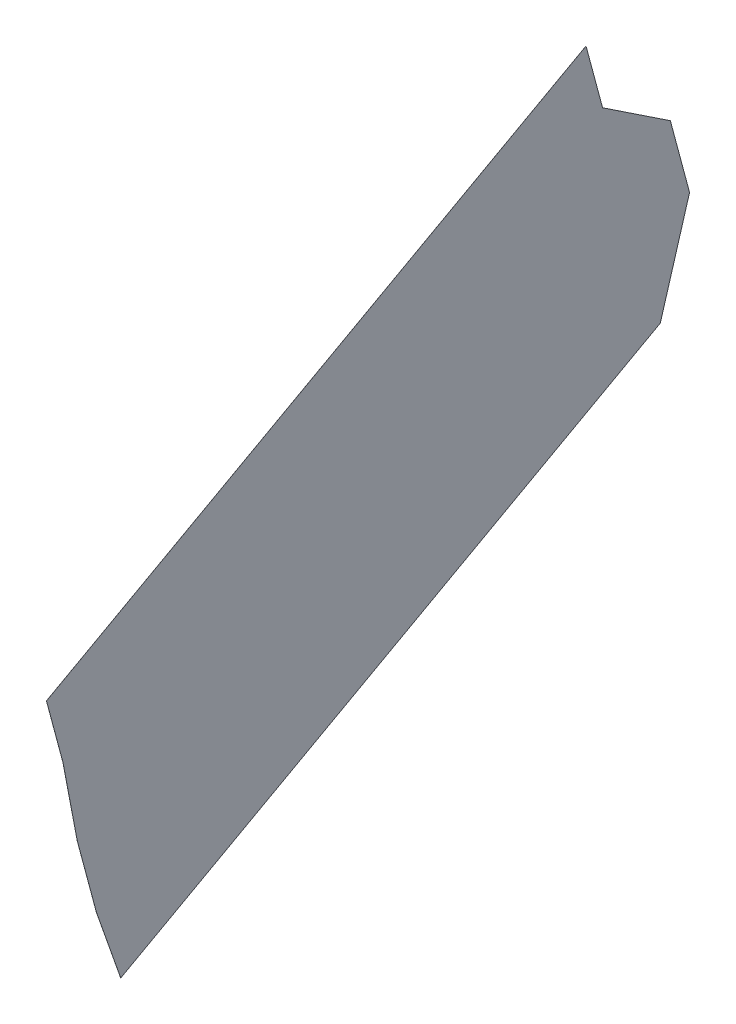
ISO-10303-21;
HEADER;
FILE_DESCRIPTION(('STEP AP214'),'2;1');
FILE_NAME('part.step','',(''),(''),'','','');
FILE_SCHEMA(('AUTOMOTIVE_DESIGN { 1 0 10303 214 1 1 1 1 }'));
ENDSEC;
DATA;
#1=APPLICATION_CONTEXT('core data for automotive mechanical design processes');
#2=APPLICATION_PROTOCOL_DEFINITION('international standard','automotive_design',2000,#1);
#3=PRODUCT_CONTEXT('',#1,'mechanical');
#4=PRODUCT('Part','Part','',(#3));
#5=PRODUCT_RELATED_PRODUCT_CATEGORY('part','',(#4));
#6=PRODUCT_DEFINITION_FORMATION('','',#4);
#7=PRODUCT_DEFINITION_CONTEXT('part definition',#1,'design');
#8=PRODUCT_DEFINITION('design','',#6,#7);
#9=PRODUCT_DEFINITION_SHAPE('','',#8);
#10=(LENGTH_UNIT() NAMED_UNIT(*) SI_UNIT(.MILLI.,.METRE.));
#11=(NAMED_UNIT(*) PLANE_ANGLE_UNIT() SI_UNIT($,.RADIAN.));
#12=(NAMED_UNIT(*) SI_UNIT($,.STERADIAN.) SOLID_ANGLE_UNIT());
#13=UNCERTAINTY_MEASURE_WITH_UNIT(LENGTH_MEASURE(1.E-05),#10,'distance_accuracy_value','');
#14=(GEOMETRIC_REPRESENTATION_CONTEXT(3) GLOBAL_UNCERTAINTY_ASSIGNED_CONTEXT((#13)) GLOBAL_UNIT_ASSIGNED_CONTEXT((#10,
#11,#12)) REPRESENTATION_CONTEXT('',''));
#15=CARTESIAN_POINT('',(0.,0.,0.));
#16=DIRECTION('',(0.,0.,1.));
#17=DIRECTION('',(1.,0.,0.));
#18=AXIS2_PLACEMENT_3D('',#15,#16,#17);
#19=CARTESIAN_POINT('',(92.6858830735072,400.506737260573,-503.289733688324));
#20=DIRECTION('',(0.173648177666827,-0.254887002244184,0.951251242564216));
#21=DIRECTION('',(0.,-0.965925826289068,-0.258819045102522));
#22=AXIS2_PLACEMENT_3D('',#19,#20,#21);
#23=PLANE('',#22);
#24=DIRECTION('',(-0.984807753012227,-0.0449434555275246,0.16773125949642));
#25=VECTOR('',#24,1.);
#26=CARTESIAN_POINT('',(92.6858830735072,400.526055777098,-503.284557307421));
#27=LINE('',#26,#25);
#28=CARTESIAN_POINT('',(92.6957311510374,400.526505211654,-503.286234620016));
#29=VERTEX_POINT('',#28);
#30=CARTESIAN_POINT('',(92.6858830735072,400.526055777098,-503.284557307421));
#31=VERTEX_POINT('',#30);
#32=EDGE_CURVE('E292',#29,#31,#27,.T.);
#33=ORIENTED_EDGE('',*,*,#32,.F.);
#34=DIRECTION('',(0.,-0.965925826289068,-0.258819045102522));
#35=VECTOR('',#34,1.);
#36=CARTESIAN_POINT('',(92.6957311510373,400.507186695128,-503.291411000918));
#37=LINE('',#36,#35);
#38=CARTESIAN_POINT('',(92.6957311510373,425.022384166345,-496.722583636216));
#39=VERTEX_POINT('',#38);
#40=EDGE_CURVE('E282',#39,#29,#37,.T.);
#41=ORIENTED_EDGE('',*,*,#40,.F.);
#42=DIRECTION('',(-0.984807753012228,-0.0449434555270907,0.167731259496532));
#43=VECTOR('',#42,1.);
#44=CARTESIAN_POINT('',(92.6858830735071,425.021934731789,-496.720906323622));
#45=LINE('',#44,#43);
#46=CARTESIAN_POINT('',(92.6858830735071,425.021934731789,-496.720906323622));
#47=VERTEX_POINT('',#46);
#48=EDGE_CURVE('E295',#39,#47,#45,.T.);
#49=ORIENTED_EDGE('',*,*,#48,.T.);
#50=DIRECTION('',(0.,-0.965925826289068,-0.258819045102522));
#51=VECTOR('',#50,1.);
#52=CARTESIAN_POINT('',(92.6858830735072,400.506737260573,-503.289733688324));
#53=LINE('',#52,#51);
#54=EDGE_CURVE('E281',#47,#31,#53,.T.);
#55=ORIENTED_EDGE('',*,*,#54,.T.);
#56=EDGE_LOOP('',(#33,#41,#49,#55));
#57=FACE_BOUND('',#56,.T.);
#58=ADVANCED_FACE('F50',(#57),#23,.T.);
#59=CARTESIAN_POINT('',(47.4423381159121,466.916829782633,-751.135573116007));
#60=DIRECTION('',(-0.173648177666827,0.254887002244181,-0.951251242564216));
#61=DIRECTION('',(0.,0.965925826289069,0.258819045102519));
#62=AXIS2_PLACEMENT_3D('',#59,#60,#61);
#63=PLANE('',#62);
#64=DIRECTION('',(-0.984807753012227,-0.0449434555275246,0.16773125949642));
#65=VECTOR('',#64,1.);
#66=CARTESIAN_POINT('',(47.442338115912,491.43202725385,-744.566745751305));
#67=LINE('',#66,#65);
#68=CARTESIAN_POINT('',(47.4521861934421,491.432476688406,-744.5684230639));
#69=VERTEX_POINT('',#68);
#70=CARTESIAN_POINT('',(47.442338115912,491.43202725385,-744.566745751305));
#71=VERTEX_POINT('',#70);
#72=EDGE_CURVE('E298',#69,#71,#67,.T.);
#73=ORIENTED_EDGE('',*,*,#72,.F.);
#74=DIRECTION('',(0.,0.965925826289069,0.258819045102519));
#75=VECTOR('',#74,1.);
#76=CARTESIAN_POINT('',(47.4521861934422,466.917279217189,-751.137250428602));
#77=LINE('',#76,#75);
#78=CARTESIAN_POINT('',(47.4521861934423,466.936597733715,-751.1320740477));
#79=VERTEX_POINT('',#78);
#80=EDGE_CURVE('E273',#79,#69,#77,.T.);
#81=ORIENTED_EDGE('',*,*,#80,.F.);
#82=DIRECTION('',(-0.984807753012296,-0.0449434555264667,0.167731259496296));
#83=VECTOR('',#82,1.);
#84=CARTESIAN_POINT('',(47.4423381159121,466.93614829916,-751.130396735105));
#85=LINE('',#84,#83);
#86=CARTESIAN_POINT('',(47.4423381159121,466.93614829916,-751.130396735105));
#87=VERTEX_POINT('',#86);
#88=EDGE_CURVE('E285',#79,#87,#85,.T.);
#89=ORIENTED_EDGE('',*,*,#88,.T.);
#90=DIRECTION('',(0.,0.965925826289069,0.258819045102519));
#91=VECTOR('',#90,1.);
#92=CARTESIAN_POINT('',(47.4423381159121,466.916829782633,-751.135573116007));
#93=LINE('',#92,#91);
#94=EDGE_CURVE('E278',#87,#71,#93,.T.);
#95=ORIENTED_EDGE('',*,*,#94,.T.);
#96=EDGE_LOOP('',(#73,#81,#89,#95));
#97=FACE_BOUND('',#96,.T.);
#98=ADVANCED_FACE('F338',(#97),#63,.T.);
#99=CARTESIAN_POINT('',(92.4929415367622,474.361735824234,-484.633172403553));
#100=DIRECTION('',(0.984807753012227,0.0449434555275245,-0.16773125949642));
#101=DIRECTION('',(-0.167900917937327,0.,-0.985803875908288));
#102=AXIS2_PLACEMENT_3D('',#99,#100,#101);
#103=PLANE('',#102);
#104=ORIENTED_EDGE('',*,*,#54,.F.);
#105=DIRECTION('',(-0.0128601669518867,0.98214989098995,0.187659819179277));
#106=VECTOR('',#105,1.);
#107=CARTESIAN_POINT('',(92.6858830735073,425.021934731789,-496.720906323622));
#108=LINE('',#107,#106);
#109=CARTESIAN_POINT('',(92.6855792285674,425.045139817351,-496.716472517539));
#110=VERTEX_POINT('',#109);
#111=EDGE_CURVE('E225',#47,#110,#108,.T.);
#112=ORIENTED_EDGE('',*,*,#111,.T.);
#113=DIRECTION('',(0.0151344359013243,-0.984465052896365,-0.174927151911033));
#114=VECTOR('',#113,1.);
#115=CARTESIAN_POINT('',(92.684417465767,425.120710184444,-496.703044606568));
#116=LINE('',#115,#114);
#117=CARTESIAN_POINT('',(92.3003038449574,450.106539751797,-492.263374562931));
#118=VERTEX_POINT('',#117);
#119=EDGE_CURVE('E217',#118,#110,#116,.T.);
#120=ORIENTED_EDGE('',*,*,#119,.F.);
#121=DIRECTION('',(-0.012860166952773,0.982149890990865,0.187659819174428));
#122=VECTOR('',#121,1.);
#123=CARTESIAN_POINT('',(92.3003038449574,450.106539751797,-492.263374562931));
#124=LINE('',#123,#122);
#125=CARTESIAN_POINT('',(92.3000000000176,450.129744837359,-492.258940756848));
#126=VERTEX_POINT('',#125);
#127=EDGE_CURVE('E198',#118,#126,#124,.T.);
#128=ORIENTED_EDGE('',*,*,#127,.T.);
#129=DIRECTION('',(0.,-0.965925826289069,-0.258819045102519));
#130=VECTOR('',#129,1.);
#131=CARTESIAN_POINT('',(92.3000000000175,474.644942308575,-485.690113392147));
#132=LINE('',#131,#130);
#133=CARTESIAN_POINT('',(92.3000000000175,471.217837476902,-486.60840336417));
#134=VERTEX_POINT('',#133);
#135=EDGE_CURVE('E185',#134,#126,#132,.T.);
#136=ORIENTED_EDGE('',*,*,#135,.F.);
#137=DIRECTION('',(-0.173648177666827,0.254887002244182,-0.951251242564216));
#138=VECTOR('',#137,1.);
#139=CARTESIAN_POINT('',(94.151817671094,468.499673305959,-476.464076574898));
#140=LINE('',#139,#138);
#141=CARTESIAN_POINT('',(51.1433244105173,531.629077055076,-712.066218818133));
#142=VERTEX_POINT('',#141);
#143=EDGE_CURVE('E175',#134,#142,#140,.T.);
#144=ORIENTED_EDGE('',*,*,#143,.T.);
#145=DIRECTION('',(0.,0.965925826289068,0.258819045102522));
#146=VECTOR('',#145,1.);
#147=CARTESIAN_POINT('',(51.1433244105172,535.05618188675,-711.147928846109));
#148=LINE('',#147,#146);
#149=CARTESIAN_POINT('',(51.1433244105174,510.540984415533,-717.716756210811));
#150=VERTEX_POINT('',#149);
#151=EDGE_CURVE('E170',#150,#142,#148,.T.);
#152=ORIENTED_EDGE('',*,*,#151,.F.);
#153=DIRECTION('',(-0.100740194295916,-0.638892968643097,-0.762671087606992));
#154=VECTOR('',#153,1.);
#155=CARTESIAN_POINT('',(51.1433244105173,510.540984415533,-717.716756210811));
#156=LINE('',#155,#154);
#157=CARTESIAN_POINT('',(51.1404102480807,510.522502836226,-717.738818382228));
#158=VERTEX_POINT('',#157);
#159=EDGE_CURVE('E195',#150,#158,#156,.T.);
#160=ORIENTED_EDGE('',*,*,#159,.T.);
#161=DIRECTION('',(0.111618897048887,0.5761039047811,0.809719403693378));
#162=VECTOR('',#161,1.);
#163=CARTESIAN_POINT('',(66.056162232926,587.507880656724,-609.535152854898));
#164=LINE('',#163,#162);
#165=CARTESIAN_POINT('',(47.4452522783488,491.450508833157,-744.544683579889));
#166=VERTEX_POINT('',#165);
#167=EDGE_CURVE('E206',#166,#158,#164,.T.);
#168=ORIENTED_EDGE('',*,*,#167,.F.);
#169=DIRECTION('',(-0.100740194298378,-0.638892968642327,-0.762671087607312));
#170=VECTOR('',#169,1.);
#171=CARTESIAN_POINT('',(47.4452522783487,491.450508833157,-744.544683579889));
#172=LINE('',#171,#170);
#173=EDGE_CURVE('E222',#166,#71,#172,.T.);
#174=ORIENTED_EDGE('',*,*,#173,.T.);
#175=ORIENTED_EDGE('',*,*,#94,.F.);
#176=DIRECTION('',(0.100740194294883,-0.934633084949946,0.341046052272089));
#177=VECTOR('',#176,1.);
#178=CARTESIAN_POINT('',(47.4423381159121,466.93614829916,-751.130396735105));
#179=LINE('',#178,#177);
#180=CARTESIAN_POINT('',(47.4452522783488,466.90911169627,-751.12053112385));
#181=VERTEX_POINT('',#180);
#182=EDGE_CURVE('E266',#87,#181,#179,.T.);
#183=ORIENTED_EDGE('',*,*,#182,.T.);
#184=DIRECTION('',(-0.111618897048893,0.903780318606531,-0.413185621145104));
#185=VECTOR('',#184,1.);
#186=CARTESIAN_POINT('',(66.056162232927,316.216222113798,-682.227533674774));
#187=LINE('',#186,#185);
#188=CARTESIAN_POINT('',(51.1433244105173,436.96575176164,-737.431180383354));
#189=VERTEX_POINT('',#188);
#190=EDGE_CURVE('E253',#189,#181,#187,.T.);
#191=ORIENTED_EDGE('',*,*,#190,.F.);
#192=DIRECTION('',(-0.173648177666827,0.254887002244182,-0.951251242564216));
#193=VECTOR('',#192,1.);
#194=CARTESIAN_POINT('',(92.4929415367625,376.271305699124,-510.916423940798));
#195=LINE('',#194,#193);
#196=CARTESIAN_POINT('',(92.3000000000178,376.554512183466,-511.973364929391));
#197=VERTEX_POINT('',#196);
#198=EDGE_CURVE('E258',#197,#189,#195,.T.);
#199=ORIENTED_EDGE('',*,*,#198,.F.);
#200=DIRECTION('',(-0.0151344359013168,-0.94003532090176,-0.340741169081568));
#201=VECTOR('',#200,1.);
#202=CARTESIAN_POINT('',(92.6844174657669,400.431582867302,-503.318476333025));
#203=LINE('',#202,#201);
#204=CARTESIAN_POINT('',(92.6855792285673,400.503742680464,-503.2923200615));
#205=VERTEX_POINT('',#204);
#206=EDGE_CURVE('E234',#205,#197,#203,.T.);
#207=ORIENTED_EDGE('',*,*,#206,.F.);
#208=DIRECTION('',(0.0128601669514656,0.944396665511476,0.328556774814924));
#209=VECTOR('',#208,1.);
#210=CARTESIAN_POINT('',(92.6855792285675,400.503742680464,-503.292320061499));
#211=LINE('',#210,#209);
#212=EDGE_CURVE('E269',#205,#31,#211,.T.);
#213=ORIENTED_EDGE('',*,*,#212,.T.);
#214=EDGE_LOOP('',(#104,#112,#120,#128,#136,#144,#152,#160,#168,#174,#175,#183,#191,#199,#207,#213));
#215=FACE_BOUND('',#214,.T.);
#216=ADVANCED_FACE('F52',(#215),#103,.F.);
#217=CARTESIAN_POINT('',(92.5027896142926,400.790393179469,-504.348351989512));
#218=DIRECTION('',(0.984807753012227,0.0449434555275246,-0.16773125949642));
#219=DIRECTION('',(0.167900917937329,-0.492901937954142,0.853731199685741));
#220=AXIS2_PLACEMENT_3D('',#217,#218,#219);
#221=PLANE('',#220);
#222=ORIENTED_EDGE('',*,*,#40,.T.);
#223=DIRECTION('',(0.0128601669514656,0.944396665511476,0.328556774814924));
#224=VECTOR('',#223,1.);
#225=CARTESIAN_POINT('',(92.6954273060976,400.504192115019,-503.293997374094));
#226=LINE('',#225,#224);
#227=CARTESIAN_POINT('',(92.6954273060975,400.504192115019,-503.293997374095));
#228=VERTEX_POINT('',#227);
#229=EDGE_CURVE('E270',#228,#29,#226,.T.);
#230=ORIENTED_EDGE('',*,*,#229,.F.);
#231=DIRECTION('',(-0.0151344359013168,-0.94003532090176,-0.340741169081568));
#232=VECTOR('',#231,1.);
#233=CARTESIAN_POINT('',(92.694265543297,400.432032301858,-503.32015364562));
#234=LINE('',#233,#232);
#235=CARTESIAN_POINT('',(92.3098480775478,376.554961618021,-511.975042241986));
#236=VERTEX_POINT('',#235);
#237=EDGE_CURVE('E249',#228,#236,#234,.T.);
#238=ORIENTED_EDGE('',*,*,#237,.T.);
#239=DIRECTION('',(-0.173648177666827,0.254887002244182,-0.951251242564216));
#240=VECTOR('',#239,1.);
#241=CARTESIAN_POINT('',(92.5027896142926,376.27175513368,-510.918101253393));
#242=LINE('',#241,#240);
#243=CARTESIAN_POINT('',(51.1531724880475,436.966201196195,-737.432857695949));
#244=VERTEX_POINT('',#243);
#245=EDGE_CURVE('E245',#236,#244,#242,.T.);
#246=ORIENTED_EDGE('',*,*,#245,.T.);
#247=DIRECTION('',(-0.111618897048893,0.903780318606531,-0.413185621145104));
#248=VECTOR('',#247,1.);
#249=CARTESIAN_POINT('',(66.0660103104571,316.216671548353,-682.229210987369));
#250=LINE('',#249,#248);
#251=CARTESIAN_POINT('',(47.4551003558787,466.909561130825,-751.122208436445));
#252=VERTEX_POINT('',#251);
#253=EDGE_CURVE('E242',#244,#252,#250,.T.);
#254=ORIENTED_EDGE('',*,*,#253,.T.);
#255=DIRECTION('',(0.100740194294883,-0.934633084949946,0.341046052272089));
#256=VECTOR('',#255,1.);
#257=CARTESIAN_POINT('',(47.4521861934422,466.936597733715,-751.1320740477));
#258=LINE('',#257,#256);
#259=EDGE_CURVE('E238',#79,#252,#258,.T.);
#260=ORIENTED_EDGE('',*,*,#259,.F.);
#261=ORIENTED_EDGE('',*,*,#80,.T.);
#262=DIRECTION('',(-0.100740194298378,-0.638892968642327,-0.762671087607312));
#263=VECTOR('',#262,1.);
#264=CARTESIAN_POINT('',(47.455100355879,491.450958267713,-744.546360892484));
#265=LINE('',#264,#263);
#266=CARTESIAN_POINT('',(47.4551003558789,491.450958267713,-744.546360892484));
#267=VERTEX_POINT('',#266);
#268=EDGE_CURVE('E209',#267,#69,#265,.T.);
#269=ORIENTED_EDGE('',*,*,#268,.F.);
#270=DIRECTION('',(0.111618897048887,0.5761039047811,0.809719403693378));
#271=VECTOR('',#270,1.);
#272=CARTESIAN_POINT('',(66.0660103104561,587.508330091279,-609.536830167492));
#273=LINE('',#272,#271);
#274=CARTESIAN_POINT('',(51.1502583256108,510.522952270782,-717.740495694823));
#275=VERTEX_POINT('',#274);
#276=EDGE_CURVE('E65',#267,#275,#273,.T.);
#277=ORIENTED_EDGE('',*,*,#276,.T.);
#278=DIRECTION('',(-0.100740194295916,-0.638892968643097,-0.762671087606992));
#279=VECTOR('',#278,1.);
#280=CARTESIAN_POINT('',(51.1531724880475,510.541433850088,-717.718433523406));
#281=LINE('',#280,#279);
#282=CARTESIAN_POINT('',(51.1531724880475,510.541433850088,-717.718433523407));
#283=VERTEX_POINT('',#282);
#284=EDGE_CURVE('E182',#283,#275,#281,.T.);
#285=ORIENTED_EDGE('',*,*,#284,.F.);
#286=DIRECTION('',(0.,0.965925826289068,0.258819045102522));
#287=VECTOR('',#286,1.);
#288=CARTESIAN_POINT('',(51.1531724880474,535.056631321305,-711.149606158704));
#289=LINE('',#288,#287);
#290=CARTESIAN_POINT('',(51.1531724880474,531.629526489631,-712.067896130729));
#291=VERTEX_POINT('',#290);
#292=EDGE_CURVE('E168',#283,#291,#289,.T.);
#293=ORIENTED_EDGE('',*,*,#292,.T.);
#294=DIRECTION('',(-0.173648177666827,0.254887002244182,-0.951251242564216));
#295=VECTOR('',#294,1.);
#296=CARTESIAN_POINT('',(94.1616657486241,468.500122740514,-476.465753887493));
#297=LINE('',#296,#295);
#298=CARTESIAN_POINT('',(92.3098480775477,471.218286911457,-486.610080676765));
#299=VERTEX_POINT('',#298);
#300=EDGE_CURVE('E176',#299,#291,#297,.T.);
#301=ORIENTED_EDGE('',*,*,#300,.F.);
#302=DIRECTION('',(0.,-0.965925826289069,-0.258819045102519));
#303=VECTOR('',#302,1.);
#304=CARTESIAN_POINT('',(92.3098480775477,474.645391743131,-485.691790704741));
#305=LINE('',#304,#303);
#306=CARTESIAN_POINT('',(92.3098480775477,450.130194271914,-492.260618069443));
#307=VERTEX_POINT('',#306);
#308=EDGE_CURVE('E184',#299,#307,#305,.T.);
#309=ORIENTED_EDGE('',*,*,#308,.T.);
#310=DIRECTION('',(-0.012860166952773,0.982149890990865,0.187659819174428));
#311=VECTOR('',#310,1.);
#312=CARTESIAN_POINT('',(92.3101519224875,450.106989186352,-492.265051875526));
#313=LINE('',#312,#311);
#314=CARTESIAN_POINT('',(92.3101519224876,450.106989186352,-492.265051875526));
#315=VERTEX_POINT('',#314);
#316=EDGE_CURVE('E199',#315,#307,#313,.T.);
#317=ORIENTED_EDGE('',*,*,#316,.F.);
#318=DIRECTION('',(0.0151344359013243,-0.984465052896365,-0.174927151911033));
#319=VECTOR('',#318,1.);
#320=CARTESIAN_POINT('',(92.6942655432971,425.121159618999,-496.704721919163));
#321=LINE('',#320,#319);
#322=CARTESIAN_POINT('',(92.6954273060975,425.045589251907,-496.718149830134));
#323=VERTEX_POINT('',#322);
#324=EDGE_CURVE('E73',#315,#323,#321,.T.);
#325=ORIENTED_EDGE('',*,*,#324,.T.);
#326=DIRECTION('',(-0.0128601669518867,0.98214989098995,0.187659819179277));
#327=VECTOR('',#326,1.);
#328=CARTESIAN_POINT('',(92.6957311510374,425.022384166344,-496.722583636216));
#329=LINE('',#328,#327);
#330=EDGE_CURVE('E226',#39,#323,#329,.T.);
#331=ORIENTED_EDGE('',*,*,#330,.F.);
#332=EDGE_LOOP('',(#222,#230,#238,#246,#254,#260,#261,#269,#277,#285,#293,#301,#309,#317,#325,#331));
#333=FACE_BOUND('',#332,.T.);
#334=ADVANCED_FACE('F179',(#333),#221,.T.);
#335=CARTESIAN_POINT('',(47.4472621546773,466.936373016437,-751.131235391403));
#336=DIRECTION('',(-0.14143939642255,-0.35276207608276,-0.924961520722568));
#337=DIRECTION('',(0.100740194294883,-0.934633084949946,0.341046052272089));
#338=AXIS2_PLACEMENT_3D('',#335,#336,#337);
#339=PLANE('',#338);
#340=ORIENTED_EDGE('',*,*,#88,.F.);
#341=ORIENTED_EDGE('',*,*,#259,.T.);
#342=DIRECTION('',(-0.984807753012227,-0.0449434555275246,0.16773125949642));
#343=VECTOR('',#342,1.);
#344=CARTESIAN_POINT('',(47.4452522783488,466.90911169627,-751.12053112385));
#345=LINE('',#344,#343);
#346=EDGE_CURVE('E229',#252,#181,#345,.T.);
#347=ORIENTED_EDGE('',*,*,#346,.T.);
#348=ORIENTED_EDGE('',*,*,#182,.F.);
#349=EDGE_LOOP('',(#340,#341,#347,#348));
#350=FACE_BOUND('',#349,.T.);
#351=ADVANCED_FACE('F343',(#350),#339,.T.);
#352=CARTESIAN_POINT('',(92.6905032673325,400.503967397741,-503.293158717797));
#353=DIRECTION('',(0.173171318967621,-0.325722311142533,0.929471177773137));
#354=DIRECTION('',(0.0128601669514656,0.944396665511476,0.328556774814924));
#355=AXIS2_PLACEMENT_3D('',#352,#353,#354);
#356=PLANE('',#355);
#357=ORIENTED_EDGE('',*,*,#229,.T.);
#358=ORIENTED_EDGE('',*,*,#32,.T.);
#359=ORIENTED_EDGE('',*,*,#212,.F.);
#360=DIRECTION('',(-0.984807753012228,-0.0449434555268331,0.167731259496603));
#361=VECTOR('',#360,1.);
#362=CARTESIAN_POINT('',(92.6855792285673,400.503742680464,-503.2923200615));
#363=LINE('',#362,#361);
#364=EDGE_CURVE('E239',#228,#205,#363,.T.);
#365=ORIENTED_EDGE('',*,*,#364,.F.);
#366=EDGE_LOOP('',(#357,#358,#359,#365));
#367=FACE_BOUND('',#366,.T.);
#368=ADVANCED_FACE('F356',(#367),#356,.T.);
#369=CARTESIAN_POINT('',(92.4929415367625,376.271305699124,-510.916423940798));
#370=DIRECTION('',(0.,-0.965925826289069,-0.25881904510252));
#371=DIRECTION('',(-0.173648177666827,0.254887002244182,-0.951251242564216));
#372=AXIS2_PLACEMENT_3D('',#369,#370,#371);
#373=PLANE('',#372);
#374=DIRECTION('',(-0.984807753012227,-0.0449434555275246,0.16773125949642));
#375=VECTOR('',#374,1.);
#376=CARTESIAN_POINT('',(51.1433244105173,436.96575176164,-737.431180383354));
#377=LINE('',#376,#375);
#378=EDGE_CURVE('E256',#244,#189,#377,.T.);
#379=ORIENTED_EDGE('',*,*,#378,.F.);
#380=ORIENTED_EDGE('',*,*,#245,.F.);
#381=DIRECTION('',(-0.984807753012227,-0.0449434555275246,0.16773125949642));
#382=VECTOR('',#381,1.);
#383=CARTESIAN_POINT('',(92.3000000000178,376.554512183466,-511.973364929391));
#384=LINE('',#383,#382);
#385=EDGE_CURVE('E262',#236,#197,#384,.T.);
#386=ORIENTED_EDGE('',*,*,#385,.T.);
#387=ORIENTED_EDGE('',*,*,#198,.T.);
#388=EDGE_LOOP('',(#379,#380,#386,#387));
#389=FACE_BOUND('',#388,.T.);
#390=ADVANCED_FACE('F349',(#389),#373,.T.);
#391=CARTESIAN_POINT('',(66.056162232927,316.216222113798,-682.227533674774));
#392=DIRECTION('',(-0.133022221559402,-0.425630381322483,-0.895066403719121));
#393=DIRECTION('',(-0.111618897048893,0.903780318606531,-0.413185621145104));
#394=AXIS2_PLACEMENT_3D('',#391,#392,#393);
#395=PLANE('',#394);
#396=ORIENTED_EDGE('',*,*,#346,.F.);
#397=ORIENTED_EDGE('',*,*,#253,.F.);
#398=ORIENTED_EDGE('',*,*,#378,.T.);
#399=ORIENTED_EDGE('',*,*,#190,.T.);
#400=EDGE_LOOP('',(#396,#397,#398,#399));
#401=FACE_BOUND('',#400,.T.);
#402=ADVANCED_FACE('F372',(#401),#395,.T.);
#403=CARTESIAN_POINT('',(92.6844174657669,400.431582867302,-503.318476333025));
#404=DIRECTION('',(0.172987393924988,-0.338103063077474,0.925073878282525));
#405=DIRECTION('',(-0.0151344359013168,-0.94003532090176,-0.340741169081568));
#406=AXIS2_PLACEMENT_3D('',#403,#404,#405);
#407=PLANE('',#406);
#408=ORIENTED_EDGE('',*,*,#385,.F.);
#409=ORIENTED_EDGE('',*,*,#237,.F.);
#410=ORIENTED_EDGE('',*,*,#364,.T.);
#411=ORIENTED_EDGE('',*,*,#206,.T.);
#412=EDGE_LOOP('',(#408,#409,#410,#411));
#413=FACE_BOUND('',#412,.T.);
#414=ADVANCED_FACE('F352',(#413),#407,.T.);
#415=CARTESIAN_POINT('',(47.4501763171139,491.450733550435,-744.545522236187));
#416=DIRECTION('',(-0.141439396421792,0.767981679745528,-0.624659136421678));
#417=DIRECTION('',(-0.100740194298378,-0.638892968642327,-0.762671087607312));
#418=AXIS2_PLACEMENT_3D('',#415,#416,#417);
#419=PLANE('',#418);
#420=DIRECTION('',(-0.984807753012428,-0.044943455529465,0.167731259494718));
#421=VECTOR('',#420,1.);
#422=CARTESIAN_POINT('',(47.4452522783488,491.450508833157,-744.544683579889));
#423=LINE('',#422,#421);
#424=EDGE_CURVE('E210',#267,#166,#423,.T.);
#425=ORIENTED_EDGE('',*,*,#424,.F.);
#426=ORIENTED_EDGE('',*,*,#268,.T.);
#427=ORIENTED_EDGE('',*,*,#72,.T.);
#428=ORIENTED_EDGE('',*,*,#173,.F.);
#429=EDGE_LOOP('',(#425,#426,#427,#428));
#430=FACE_BOUND('',#429,.T.);
#431=ADVANCED_FACE('F335',(#430),#419,.T.);
#432=CARTESIAN_POINT('',(92.6908071122723,425.022159449067,-496.721744979919));
#433=DIRECTION('',(0.173171318967603,-0.182651792856451,0.967806807608494));
#434=DIRECTION('',(-0.0128601669518867,0.98214989098995,0.187659819179277));
#435=AXIS2_PLACEMENT_3D('',#432,#433,#434);
#436=PLANE('',#435);
#437=ORIENTED_EDGE('',*,*,#330,.T.);
#438=DIRECTION('',(-0.984807753012227,-0.0449434555275245,0.16773125949642));
#439=VECTOR('',#438,1.);
#440=CARTESIAN_POINT('',(92.6855792285674,425.045139817351,-496.716472517539));
#441=LINE('',#440,#439);
#442=EDGE_CURVE('E202',#323,#110,#441,.T.);
#443=ORIENTED_EDGE('',*,*,#442,.T.);
#444=ORIENTED_EDGE('',*,*,#111,.F.);
#445=ORIENTED_EDGE('',*,*,#48,.F.);
#446=EDGE_LOOP('',(#437,#443,#444,#445));
#447=FACE_BOUND('',#446,.T.);
#448=ADVANCED_FACE('F311',(#447),#436,.T.);
#449=CARTESIAN_POINT('',(92.684417465767,425.120710184444,-496.703044606568));
#450=DIRECTION('',(0.172987393924987,-0.169731097418835,0.970189010508798));
#451=DIRECTION('',(0.0151344359013243,-0.984465052896365,-0.174927151911033));
#452=AXIS2_PLACEMENT_3D('',#449,#450,#451);
#453=PLANE('',#452);
#454=ORIENTED_EDGE('',*,*,#442,.F.);
#455=ORIENTED_EDGE('',*,*,#324,.F.);
#456=DIRECTION('',(-0.984807753012226,-0.0449434555277941,0.167731259496351));
#457=VECTOR('',#456,1.);
#458=CARTESIAN_POINT('',(92.3003038449574,450.106539751797,-492.263374562931));
#459=LINE('',#458,#457);
#460=EDGE_CURVE('E58',#315,#118,#459,.T.);
#461=ORIENTED_EDGE('',*,*,#460,.T.);
#462=ORIENTED_EDGE('',*,*,#119,.T.);
#463=EDGE_LOOP('',(#454,#455,#461,#462));
#464=FACE_BOUND('',#463,.T.);
#465=ADVANCED_FACE('F301',(#464),#453,.T.);
#466=CARTESIAN_POINT('',(66.056162232926,587.507880656724,-609.535152854898));
#467=DIRECTION('',(-0.133022221559406,0.816139924707286,-0.562335053033497));
#468=DIRECTION('',(0.111618897048887,0.5761039047811,0.809719403693378));
#469=AXIS2_PLACEMENT_3D('',#466,#467,#468);
#470=PLANE('',#469);
#471=DIRECTION('',(-0.984807753012227,-0.0449434555275245,0.16773125949642));
#472=VECTOR('',#471,1.);
#473=CARTESIAN_POINT('',(51.1404102480807,510.522502836226,-717.738818382228));
#474=LINE('',#473,#472);
#475=EDGE_CURVE('E12',#275,#158,#474,.T.);
#476=ORIENTED_EDGE('',*,*,#475,.F.);
#477=ORIENTED_EDGE('',*,*,#276,.F.);
#478=ORIENTED_EDGE('',*,*,#424,.T.);
#479=ORIENTED_EDGE('',*,*,#167,.T.);
#480=EDGE_LOOP('',(#476,#477,#478,#479));
#481=FACE_BOUND('',#480,.T.);
#482=ADVANCED_FACE('F331',(#481),#470,.T.);
#483=CARTESIAN_POINT('',(51.1482484492824,510.541209132811,-717.717594867109));
#484=DIRECTION('',(-0.141439396421907,0.767981679744801,-0.624659136422546));
#485=DIRECTION('',(-0.100740194295916,-0.638892968643097,-0.762671087606992));
#486=AXIS2_PLACEMENT_3D('',#483,#484,#485);
#487=PLANE('',#486);
#488=DIRECTION('',(-0.984807753012307,-0.044943455524185,0.167731259496845));
#489=VECTOR('',#488,1.);
#490=CARTESIAN_POINT('',(51.1433244105174,510.540984415533,-717.716756210811));
#491=LINE('',#490,#489);
#492=EDGE_CURVE('E317',#283,#150,#491,.T.);
#493=ORIENTED_EDGE('',*,*,#492,.F.);
#494=ORIENTED_EDGE('',*,*,#284,.T.);
#495=ORIENTED_EDGE('',*,*,#475,.T.);
#496=ORIENTED_EDGE('',*,*,#159,.F.);
#497=EDGE_LOOP('',(#493,#494,#495,#496));
#498=FACE_BOUND('',#497,.T.);
#499=ADVANCED_FACE('F329',(#498),#487,.T.);
#500=CARTESIAN_POINT('',(92.3052278837225,450.106764469075,-492.264213219228));
#501=DIRECTION('',(0.173171318967539,-0.182651792851527,0.967806807609435));
#502=DIRECTION('',(-0.012860166952773,0.982149890990865,0.187659819174428));
#503=AXIS2_PLACEMENT_3D('',#500,#501,#502);
#504=PLANE('',#503);
#505=ORIENTED_EDGE('',*,*,#316,.T.);
#506=DIRECTION('',(-0.984807753012227,-0.0449434555275245,0.16773125949642));
#507=VECTOR('',#506,1.);
#508=CARTESIAN_POINT('',(92.3000000000176,450.129744837359,-492.258940756849));
#509=LINE('',#508,#507);
#510=EDGE_CURVE('E189',#307,#126,#509,.T.);
#511=ORIENTED_EDGE('',*,*,#510,.T.);
#512=ORIENTED_EDGE('',*,*,#127,.F.);
#513=ORIENTED_EDGE('',*,*,#460,.F.);
#514=EDGE_LOOP('',(#505,#511,#512,#513));
#515=FACE_BOUND('',#514,.T.);
#516=ADVANCED_FACE('F304',(#515),#504,.T.);
#517=CARTESIAN_POINT('',(94.151817671094,468.499673305959,-476.464076574898));
#518=DIRECTION('',(0.,-0.965925826289068,-0.25881904510252));
#519=DIRECTION('',(-0.173648177666827,0.254887002244182,-0.951251242564216));
#520=AXIS2_PLACEMENT_3D('',#517,#518,#519);
#521=PLANE('',#520);
#522=DIRECTION('',(-0.984807753012227,-0.0449434555275245,0.16773125949642));
#523=VECTOR('',#522,1.);
#524=CARTESIAN_POINT('',(92.3000000000175,471.217837476902,-486.60840336417));
#525=LINE('',#524,#523);
#526=EDGE_CURVE('E188',#299,#134,#525,.T.);
#527=ORIENTED_EDGE('',*,*,#526,.F.);
#528=ORIENTED_EDGE('',*,*,#300,.T.);
#529=DIRECTION('',(-0.984807753012227,-0.0449434555275245,0.16773125949642));
#530=VECTOR('',#529,1.);
#531=CARTESIAN_POINT('',(51.1433244105173,531.629077055076,-712.066218818133));
#532=LINE('',#531,#530);
#533=EDGE_CURVE('E164',#291,#142,#532,.T.);
#534=ORIENTED_EDGE('',*,*,#533,.T.);
#535=ORIENTED_EDGE('',*,*,#143,.F.);
#536=EDGE_LOOP('',(#527,#528,#534,#535));
#537=FACE_BOUND('',#536,.T.);
#538=ADVANCED_FACE('F187',(#537),#521,.F.);
#539=CARTESIAN_POINT('',(92.3000000000175,474.644942308575,-485.690113392147));
#540=DIRECTION('',(0.173648177666827,-0.254887002244181,0.951251242564216));
#541=DIRECTION('',(0.,-0.965925826289069,-0.258819045102519));
#542=AXIS2_PLACEMENT_3D('',#539,#540,#541);
#543=PLANE('',#542);
#544=ORIENTED_EDGE('',*,*,#510,.F.);
#545=ORIENTED_EDGE('',*,*,#308,.F.);
#546=ORIENTED_EDGE('',*,*,#526,.T.);
#547=ORIENTED_EDGE('',*,*,#135,.T.);
#548=EDGE_LOOP('',(#544,#545,#546,#547));
#549=FACE_BOUND('',#548,.T.);
#550=ADVANCED_FACE('F319',(#549),#543,.T.);
#551=CARTESIAN_POINT('',(51.1433244105172,535.05618188675,-711.147928846109));
#552=DIRECTION('',(-0.173648177666827,0.254887002244184,-0.951251242564215));
#553=DIRECTION('',(0.,0.965925826289068,0.258819045102522));
#554=AXIS2_PLACEMENT_3D('',#551,#552,#553);
#555=PLANE('',#554);
#556=ORIENTED_EDGE('',*,*,#533,.F.);
#557=ORIENTED_EDGE('',*,*,#292,.F.);
#558=ORIENTED_EDGE('',*,*,#492,.T.);
#559=ORIENTED_EDGE('',*,*,#151,.T.);
#560=EDGE_LOOP('',(#556,#557,#558,#559));
#561=FACE_BOUND('',#560,.T.);
#562=ADVANCED_FACE('F166',(#561),#555,.T.);
#563=CLOSED_SHELL('',(#58,#98,#216,#334,#351,#368,#390,#402,#414,#431,#448,#465,#482,#499,#516,
#538,#550,#562));
#564=MANIFOLD_SOLID_BREP('B2',#563);
#565=ADVANCED_BREP_SHAPE_REPRESENTATION('',(#18,#564),#14);
#566=SHAPE_DEFINITION_REPRESENTATION(#9,#565);
ENDSEC;
END-ISO-10303-21;
